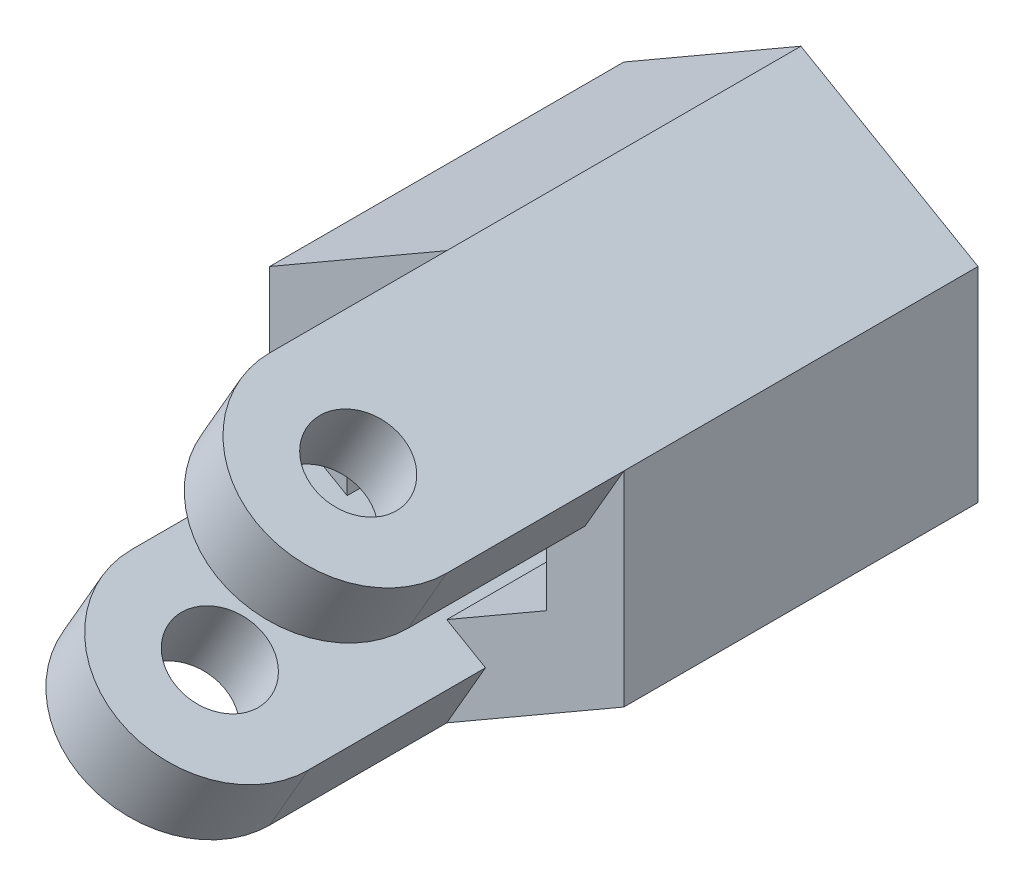
ISO-10303-21;
HEADER;
FILE_DESCRIPTION(('STEP AP214'),'2;1');
FILE_NAME('part.step','',(''),(''),'','','');
FILE_SCHEMA(('AUTOMOTIVE_DESIGN { 1 0 10303 214 1 1 1 1 }'));
ENDSEC;
DATA;
#1=APPLICATION_CONTEXT('core data for automotive mechanical design processes');
#2=APPLICATION_PROTOCOL_DEFINITION('international standard','automotive_design',2000,#1);
#3=PRODUCT_CONTEXT('',#1,'mechanical');
#4=PRODUCT('Part','Part','',(#3));
#5=PRODUCT_RELATED_PRODUCT_CATEGORY('part','',(#4));
#6=PRODUCT_DEFINITION_FORMATION('','',#4);
#7=PRODUCT_DEFINITION_CONTEXT('part definition',#1,'design');
#8=PRODUCT_DEFINITION('design','',#6,#7);
#9=PRODUCT_DEFINITION_SHAPE('','',#8);
#10=(LENGTH_UNIT() NAMED_UNIT(*) SI_UNIT(.MILLI.,.METRE.));
#11=(NAMED_UNIT(*) PLANE_ANGLE_UNIT() SI_UNIT($,.RADIAN.));
#12=(NAMED_UNIT(*) SI_UNIT($,.STERADIAN.) SOLID_ANGLE_UNIT());
#13=UNCERTAINTY_MEASURE_WITH_UNIT(LENGTH_MEASURE(1.E-05),#10,'distance_accuracy_value','');
#14=(GEOMETRIC_REPRESENTATION_CONTEXT(3) GLOBAL_UNCERTAINTY_ASSIGNED_CONTEXT((#13)) GLOBAL_UNIT_ASSIGNED_CONTEXT((#10,
#11,#12)) REPRESENTATION_CONTEXT('',''));
#15=CARTESIAN_POINT('',(0.,0.,0.));
#16=DIRECTION('',(0.,0.,1.));
#17=DIRECTION('',(1.,0.,0.));
#18=AXIS2_PLACEMENT_3D('',#15,#16,#17);
#19=CARTESIAN_POINT('',(0.,0.,6.));
#20=DIRECTION('',(0.,0.,1.));
#21=DIRECTION('',(1.,0.,0.));
#22=AXIS2_PLACEMENT_3D('',#19,#20,#21);
#23=PLANE('',#22);
#24=DIRECTION('',(-0.5,-0.866025403784439,0.));
#25=VECTOR('',#24,1.);
#26=CARTESIAN_POINT('',(4.78466351751448,3.6684781559393,6.));
#27=LINE('',#26,#25);
#28=CARTESIAN_POINT('',(0.875000000000009,-3.10325769689422,6.));
#29=VERTEX_POINT('',#28);
#30=CARTESIAN_POINT('',(0.,-4.61880215351701,6.));
#31=VERTEX_POINT('',#30);
#32=EDGE_CURVE('E174',#29,#31,#27,.T.);
#33=ORIENTED_EDGE('',*,*,#32,.T.);
#34=DIRECTION('',(0.866025403784439,0.5,0.));
#35=VECTOR('',#34,1.);
#36=CARTESIAN_POINT('',(0.,-4.618802153517,6.));
#37=LINE('',#36,#35);
#38=CARTESIAN_POINT('',(4.,-2.3094010767585,6.));
#39=VERTEX_POINT('',#38);
#40=EDGE_CURVE('E58',#31,#39,#37,.T.);
#41=ORIENTED_EDGE('',*,*,#40,.T.);
#42=DIRECTION('',(0.,1.,0.));
#43=VECTOR('',#42,1.);
#44=CARTESIAN_POINT('',(4.,-2.3094010767585,6.));
#45=LINE('',#44,#43);
#46=CARTESIAN_POINT('',(4.,2.3094010767585,6.));
#47=VERTEX_POINT('',#46);
#48=EDGE_CURVE('E300',#39,#47,#45,.T.);
#49=ORIENTED_EDGE('',*,*,#48,.T.);
#50=DIRECTION('',(0.5,0.866025403784438,0.));
#51=VECTOR('',#50,1.);
#52=CARTESIAN_POINT('',(-0.784663517514478,-5.97787923269779,6.));
#53=LINE('',#52,#51);
#54=CARTESIAN_POINT('',(3.12500000000001,0.79385662013575,6.));
#55=VERTEX_POINT('',#54);
#56=EDGE_CURVE('E221',#55,#47,#53,.T.);
#57=ORIENTED_EDGE('',*,*,#56,.F.);
#58=DIRECTION('',(-0.866025403784442,0.499999999999995,0.));
#59=VECTOR('',#58,1.);
#60=CARTESIAN_POINT('',(-0.875000000000047,3.10325769689425,6.));
#61=LINE('',#60,#59);
#62=CARTESIAN_POINT('',(2.24999999999998,1.29903810567668,6.));
#63=VERTEX_POINT('',#62);
#64=EDGE_CURVE('E43',#55,#63,#61,.T.);
#65=ORIENTED_EDGE('',*,*,#64,.T.);
#66=DIRECTION('',(0.,1.,0.));
#67=VECTOR('',#66,1.);
#68=CARTESIAN_POINT('',(2.25000000000001,-1.29903810567664,6.));
#69=LINE('',#68,#67);
#70=CARTESIAN_POINT('',(2.25000000000001,-1.29903810567664,6.));
#71=VERTEX_POINT('',#70);
#72=EDGE_CURVE('E267',#71,#63,#69,.T.);
#73=ORIENTED_EDGE('',*,*,#72,.F.);
#74=DIRECTION('',(0.866025403784435,0.500000000000007,0.));
#75=VECTOR('',#74,1.);
#76=CARTESIAN_POINT('',(0.,-2.59807621135331,6.));
#77=LINE('',#76,#75);
#78=CARTESIAN_POINT('',(0.,-2.59807621135331,6.));
#79=VERTEX_POINT('',#78);
#80=EDGE_CURVE('E265',#79,#71,#77,.T.);
#81=ORIENTED_EDGE('',*,*,#80,.F.);
#82=DIRECTION('',(0.866025403784442,-0.499999999999995,0.));
#83=VECTOR('',#82,1.);
#84=CARTESIAN_POINT('',(-3.12499999999997,-0.793856620135766,6.));
#85=LINE('',#84,#83);
#86=EDGE_CURVE('E175',#79,#29,#85,.T.);
#87=ORIENTED_EDGE('',*,*,#86,.T.);
#88=EDGE_LOOP('',(#33,#41,#49,#57,#65,#73,#81,#87));
#89=FACE_BOUND('',#88,.T.);
#90=ADVANCED_FACE('F33',(#89),#23,.T.);
#91=DIRECTION('',(-0.5,-0.866025403784439,0.));
#92=VECTOR('',#91,1.);
#93=CARTESIAN_POINT('',(0.784663517514478,5.9778792326978,6.));
#94=LINE('',#93,#92);
#95=CARTESIAN_POINT('',(-3.125,-0.793856620135743,6.));
#96=VERTEX_POINT('',#95);
#97=CARTESIAN_POINT('',(-4.,-2.30940107675851,6.));
#98=VERTEX_POINT('',#97);
#99=EDGE_CURVE('E181',#96,#98,#94,.T.);
#100=ORIENTED_EDGE('',*,*,#99,.F.);
#101=CARTESIAN_POINT('',(-2.24999999999999,-1.29903810567667,6.));
#102=VERTEX_POINT('',#101);
#103=EDGE_CURVE('E162',#96,#102,#85,.T.);
#104=ORIENTED_EDGE('',*,*,#103,.T.);
#105=DIRECTION('',(0.,-1.,0.));
#106=VECTOR('',#105,1.);
#107=CARTESIAN_POINT('',(-2.25,1.29903810567665,6.));
#108=LINE('',#107,#106);
#109=CARTESIAN_POINT('',(-2.25,1.29903810567665,6.));
#110=VERTEX_POINT('',#109);
#111=EDGE_CURVE('E262',#110,#102,#108,.T.);
#112=ORIENTED_EDGE('',*,*,#111,.F.);
#113=DIRECTION('',(-0.866025403784438,-0.500000000000001,0.));
#114=VECTOR('',#113,1.);
#115=CARTESIAN_POINT('',(0.,2.59807621135331,6.));
#116=LINE('',#115,#114);
#117=CARTESIAN_POINT('',(0.,2.59807621135331,6.));
#118=VERTEX_POINT('',#117);
#119=EDGE_CURVE('E260',#118,#110,#116,.T.);
#120=ORIENTED_EDGE('',*,*,#119,.F.);
#121=CARTESIAN_POINT('',(-0.875000000000005,3.10325769689423,6.));
#122=VERTEX_POINT('',#121);
#123=EDGE_CURVE('E11',#118,#122,#61,.T.);
#124=ORIENTED_EDGE('',*,*,#123,.T.);
#125=DIRECTION('',(0.5,0.866025403784438,0.));
#126=VECTOR('',#125,1.);
#127=CARTESIAN_POINT('',(-4.78466351751448,-3.66847815593928,6.));
#128=LINE('',#127,#126);
#129=CARTESIAN_POINT('',(0.,4.61880215351701,6.));
#130=VERTEX_POINT('',#129);
#131=EDGE_CURVE('E227',#122,#130,#128,.T.);
#132=ORIENTED_EDGE('',*,*,#131,.T.);
#133=DIRECTION('',(-0.866025403784439,-0.5,0.));
#134=VECTOR('',#133,1.);
#135=CARTESIAN_POINT('',(0.,4.61880215351701,6.));
#136=LINE('',#135,#134);
#137=CARTESIAN_POINT('',(-4.,2.3094010767585,6.));
#138=VERTEX_POINT('',#137);
#139=EDGE_CURVE('E296',#130,#138,#136,.T.);
#140=ORIENTED_EDGE('',*,*,#139,.T.);
#141=DIRECTION('',(0.,-1.,0.));
#142=VECTOR('',#141,1.);
#143=CARTESIAN_POINT('',(-4.,2.3094010767585,6.));
#144=LINE('',#143,#142);
#145=EDGE_CURVE('E188',#138,#98,#144,.T.);
#146=ORIENTED_EDGE('',*,*,#145,.T.);
#147=EDGE_LOOP('',(#100,#104,#112,#120,#124,#132,#140,#146));
#148=FACE_BOUND('',#147,.T.);
#149=ADVANCED_FACE('F186',(#148),#23,.T.);
#150=CARTESIAN_POINT('',(4.,2.3094010767585,6.));
#151=DIRECTION('',(-0.5,-0.866025403784438,0.));
#152=DIRECTION('',(0.866025403784439,-0.5,0.));
#153=AXIS2_PLACEMENT_3D('',#150,#151,#152);
#154=PLANE('',#153);
#155=DIRECTION('',(0.,0.,-1.));
#156=VECTOR('',#155,1.);
#157=CARTESIAN_POINT('',(4.,2.3094010767585,6.));
#158=LINE('',#157,#156);
#159=CARTESIAN_POINT('',(4.,2.3094010767585,-2.));
#160=VERTEX_POINT('',#159);
#161=EDGE_CURVE('E302',#47,#160,#158,.T.);
#162=ORIENTED_EDGE('',*,*,#161,.T.);
#163=DIRECTION('',(0.866025403784439,-0.5,0.));
#164=VECTOR('',#163,1.);
#165=CARTESIAN_POINT('',(0.,4.61880215351701,-2.));
#166=LINE('',#165,#164);
#167=CARTESIAN_POINT('',(0.,4.61880215351701,-2.));
#168=VERTEX_POINT('',#167);
#169=EDGE_CURVE('E244',#168,#160,#166,.T.);
#170=ORIENTED_EDGE('',*,*,#169,.F.);
#171=DIRECTION('',(0.,0.,-1.));
#172=VECTOR('',#171,1.);
#173=CARTESIAN_POINT('',(0.,4.61880215351701,6.));
#174=LINE('',#173,#172);
#175=EDGE_CURVE('E37',#130,#168,#174,.T.);
#176=ORIENTED_EDGE('',*,*,#175,.F.);
#177=DIRECTION('',(0.,0.,1.));
#178=VECTOR('',#177,1.);
#179=CARTESIAN_POINT('',(0.,4.61880215351701,6.));
#180=LINE('',#179,#178);
#181=CARTESIAN_POINT('',(0.,4.61880215351701,10.));
#182=VERTEX_POINT('',#181);
#183=EDGE_CURVE('E208',#130,#182,#180,.T.);
#184=ORIENTED_EDGE('',*,*,#183,.T.);
#185=CARTESIAN_POINT('',(2.,3.46410161513776,10.));
#186=DIRECTION('',(0.5,0.866025403784438,0.));
#187=DIRECTION('',(-0.866025403784439,0.5,0.));
#188=AXIS2_PLACEMENT_3D('',#185,#186,#187);
#189=CIRCLE('',#188,2.3094010767585);
#190=CARTESIAN_POINT('',(4.,2.3094010767585,10.));
#191=VERTEX_POINT('',#190);
#192=EDGE_CURVE('E205',#182,#191,#189,.T.);
#193=ORIENTED_EDGE('',*,*,#192,.T.);
#194=DIRECTION('',(0.,0.,-1.));
#195=VECTOR('',#194,1.);
#196=CARTESIAN_POINT('',(4.,2.3094010767585,6.));
#197=LINE('',#196,#195);
#198=EDGE_CURVE('E201',#191,#47,#197,.T.);
#199=ORIENTED_EDGE('',*,*,#198,.T.);
#200=EDGE_LOOP('',(#162,#170,#176,#184,#193,#199));
#201=FACE_BOUND('',#200,.T.);
#202=CARTESIAN_POINT('',(2.,3.46410161513776,10.));
#203=DIRECTION('',(0.5,0.866025403784438,0.));
#204=DIRECTION('',(-0.866025403784439,0.5,0.));
#205=AXIS2_PLACEMENT_3D('',#202,#203,#204);
#206=CIRCLE('',#205,1.);
#207=CARTESIAN_POINT('',(1.13397459621556,3.96410161513776,10.));
#208=VERTEX_POINT('',#207);
#209=EDGE_CURVE('E211',#208,#208,#206,.T.);
#210=ORIENTED_EDGE('',*,*,#209,.F.);
#211=EDGE_LOOP('',(#210));
#212=FACE_BOUND('',#211,.T.);
#213=ADVANCED_FACE('F35',(#201,#212),#154,.F.);
#214=CARTESIAN_POINT('',(0.,4.61880215351701,6.));
#215=DIRECTION('',(0.5,-0.866025403784439,0.));
#216=DIRECTION('',(0.866025403784439,0.5,0.));
#217=AXIS2_PLACEMENT_3D('',#214,#215,#216);
#218=PLANE('',#217);
#219=ORIENTED_EDGE('',*,*,#175,.T.);
#220=DIRECTION('',(0.866025403784439,0.5,0.));
#221=VECTOR('',#220,1.);
#222=CARTESIAN_POINT('',(-4.,2.3094010767585,-2.));
#223=LINE('',#222,#221);
#224=CARTESIAN_POINT('',(-4.,2.3094010767585,-2.));
#225=VERTEX_POINT('',#224);
#226=EDGE_CURVE('E239',#225,#168,#223,.T.);
#227=ORIENTED_EDGE('',*,*,#226,.F.);
#228=DIRECTION('',(0.,0.,-1.));
#229=VECTOR('',#228,1.);
#230=CARTESIAN_POINT('',(-4.,2.3094010767585,6.));
#231=LINE('',#230,#229);
#232=EDGE_CURVE('E309',#138,#225,#231,.T.);
#233=ORIENTED_EDGE('',*,*,#232,.F.);
#234=ORIENTED_EDGE('',*,*,#139,.F.);
#235=EDGE_LOOP('',(#219,#227,#233,#234));
#236=FACE_BOUND('',#235,.T.);
#237=ADVANCED_FACE('F318',(#236),#218,.F.);
#238=CARTESIAN_POINT('',(-4.,2.3094010767585,6.));
#239=DIRECTION('',(1.,0.,0.));
#240=DIRECTION('',(0.,1.,0.));
#241=AXIS2_PLACEMENT_3D('',#238,#239,#240);
#242=PLANE('',#241);
#243=ORIENTED_EDGE('',*,*,#232,.T.);
#244=DIRECTION('',(0.,1.,0.));
#245=VECTOR('',#244,1.);
#246=CARTESIAN_POINT('',(-4.,-2.30940107675851,-2.));
#247=LINE('',#246,#245);
#248=CARTESIAN_POINT('',(-4.,-2.30940107675851,-2.));
#249=VERTEX_POINT('',#248);
#250=EDGE_CURVE('E256',#249,#225,#247,.T.);
#251=ORIENTED_EDGE('',*,*,#250,.F.);
#252=DIRECTION('',(0.,0.,-1.));
#253=VECTOR('',#252,1.);
#254=CARTESIAN_POINT('',(-4.,-2.3094010767585,6.));
#255=LINE('',#254,#253);
#256=EDGE_CURVE('E308',#98,#249,#255,.T.);
#257=ORIENTED_EDGE('',*,*,#256,.F.);
#258=ORIENTED_EDGE('',*,*,#145,.F.);
#259=EDGE_LOOP('',(#243,#251,#257,#258));
#260=FACE_BOUND('',#259,.T.);
#261=ADVANCED_FACE('F327',(#260),#242,.F.);
#262=CARTESIAN_POINT('',(-4.,-2.3094010767585,6.));
#263=DIRECTION('',(0.5,0.866025403784439,0.));
#264=DIRECTION('',(-0.866025403784439,0.5,0.));
#265=AXIS2_PLACEMENT_3D('',#262,#263,#264);
#266=PLANE('',#265);
#267=ORIENTED_EDGE('',*,*,#256,.T.);
#268=DIRECTION('',(-0.866025403784439,0.5,0.));
#269=VECTOR('',#268,1.);
#270=CARTESIAN_POINT('',(0.,-4.61880215351701,-2.));
#271=LINE('',#270,#269);
#272=CARTESIAN_POINT('',(0.,-4.61880215351701,-2.));
#273=VERTEX_POINT('',#272);
#274=EDGE_CURVE('E253',#273,#249,#271,.T.);
#275=ORIENTED_EDGE('',*,*,#274,.F.);
#276=DIRECTION('',(0.,0.,-1.));
#277=VECTOR('',#276,1.);
#278=CARTESIAN_POINT('',(0.,-4.618802153517,6.));
#279=LINE('',#278,#277);
#280=EDGE_CURVE('E306',#31,#273,#279,.T.);
#281=ORIENTED_EDGE('',*,*,#280,.F.);
#282=DIRECTION('',(0.,0.,1.));
#283=VECTOR('',#282,1.);
#284=CARTESIAN_POINT('',(0.,-4.61880215351701,10.));
#285=LINE('',#284,#283);
#286=CARTESIAN_POINT('',(0.,-4.61880215351701,10.));
#287=VERTEX_POINT('',#286);
#288=EDGE_CURVE('E336',#31,#287,#285,.T.);
#289=ORIENTED_EDGE('',*,*,#288,.T.);
#290=CARTESIAN_POINT('',(-2.,-3.46410161513776,10.));
#291=DIRECTION('',(-0.5,-0.866025403784439,0.));
#292=DIRECTION('',(0.866025403784439,-0.5,0.));
#293=AXIS2_PLACEMENT_3D('',#290,#291,#292);
#294=CIRCLE('',#293,2.3094010767585);
#295=CARTESIAN_POINT('',(-4.,-2.30940107675851,10.));
#296=VERTEX_POINT('',#295);
#297=EDGE_CURVE('E193',#287,#296,#294,.T.);
#298=ORIENTED_EDGE('',*,*,#297,.T.);
#299=DIRECTION('',(0.,0.,-1.));
#300=VECTOR('',#299,1.);
#301=CARTESIAN_POINT('',(-4.,-2.30940107675851,10.));
#302=LINE('',#301,#300);
#303=EDGE_CURVE('E333',#296,#98,#302,.T.);
#304=ORIENTED_EDGE('',*,*,#303,.T.);
#305=EDGE_LOOP('',(#267,#275,#281,#289,#298,#304));
#306=FACE_BOUND('',#305,.T.);
#307=CARTESIAN_POINT('',(-2.,-3.46410161513776,10.));
#308=DIRECTION('',(-0.5,-0.866025403784439,0.));
#309=DIRECTION('',(0.866025403784439,-0.5,0.));
#310=AXIS2_PLACEMENT_3D('',#307,#308,#309);
#311=CIRCLE('',#310,1.);
#312=CARTESIAN_POINT('',(-1.13397459621556,-3.96410161513776,10.));
#313=VERTEX_POINT('',#312);
#314=EDGE_CURVE('E190',#313,#313,#311,.T.);
#315=ORIENTED_EDGE('',*,*,#314,.F.);
#316=EDGE_LOOP('',(#315));
#317=FACE_BOUND('',#316,.T.);
#318=ADVANCED_FACE('F329',(#306,#317),#266,.F.);
#319=CARTESIAN_POINT('',(0.,-4.618802153517,6.));
#320=DIRECTION('',(-0.5,0.866025403784439,0.));
#321=DIRECTION('',(-0.866025403784439,-0.5,0.));
#322=AXIS2_PLACEMENT_3D('',#319,#320,#321);
#323=PLANE('',#322);
#324=ORIENTED_EDGE('',*,*,#280,.T.);
#325=DIRECTION('',(-0.866025403784439,-0.5,0.));
#326=VECTOR('',#325,1.);
#327=CARTESIAN_POINT('',(4.,-2.30940107675851,-2.));
#328=LINE('',#327,#326);
#329=CARTESIAN_POINT('',(4.,-2.30940107675851,-2.));
#330=VERTEX_POINT('',#329);
#331=EDGE_CURVE('E250',#330,#273,#328,.T.);
#332=ORIENTED_EDGE('',*,*,#331,.F.);
#333=DIRECTION('',(0.,0.,-1.));
#334=VECTOR('',#333,1.);
#335=CARTESIAN_POINT('',(4.,-2.3094010767585,6.));
#336=LINE('',#335,#334);
#337=EDGE_CURVE('E304',#39,#330,#336,.T.);
#338=ORIENTED_EDGE('',*,*,#337,.F.);
#339=ORIENTED_EDGE('',*,*,#40,.F.);
#340=EDGE_LOOP('',(#324,#332,#338,#339));
#341=FACE_BOUND('',#340,.T.);
#342=ADVANCED_FACE('F383',(#341),#323,.F.);
#343=CARTESIAN_POINT('',(4.,-2.3094010767585,6.));
#344=DIRECTION('',(-1.,0.,0.));
#345=DIRECTION('',(0.,0.,1.));
#346=AXIS2_PLACEMENT_3D('',#343,#344,#345);
#347=PLANE('',#346);
#348=ORIENTED_EDGE('',*,*,#337,.T.);
#349=DIRECTION('',(0.,-1.,0.));
#350=VECTOR('',#349,1.);
#351=CARTESIAN_POINT('',(4.,2.3094010767585,-2.));
#352=LINE('',#351,#350);
#353=EDGE_CURVE('E247',#160,#330,#352,.T.);
#354=ORIENTED_EDGE('',*,*,#353,.F.);
#355=ORIENTED_EDGE('',*,*,#161,.F.);
#356=ORIENTED_EDGE('',*,*,#48,.F.);
#357=EDGE_LOOP('',(#348,#354,#355,#356));
#358=FACE_BOUND('',#357,.T.);
#359=ADVANCED_FACE('F380',(#358),#347,.F.);
#360=CARTESIAN_POINT('',(2.24999999999998,1.29903810567668,6.));
#361=DIRECTION('',(-0.499999999999995,-0.866025403784441,0.));
#362=DIRECTION('',(0.866025403784442,-0.499999999999995,0.));
#363=AXIS2_PLACEMENT_3D('',#360,#361,#362);
#364=PLANE('',#363);
#365=DIRECTION('',(-0.866025403784442,0.499999999999995,0.));
#366=VECTOR('',#365,1.);
#367=CARTESIAN_POINT('',(2.24999999999998,1.29903810567668,0.));
#368=LINE('',#367,#366);
#369=CARTESIAN_POINT('',(2.24999999999998,1.29903810567668,0.));
#370=VERTEX_POINT('',#369);
#371=CARTESIAN_POINT('',(0.,2.59807621135331,0.));
#372=VERTEX_POINT('',#371);
#373=EDGE_CURVE('E259',#370,#372,#368,.T.);
#374=ORIENTED_EDGE('',*,*,#373,.F.);
#375=DIRECTION('',(0.,0.,-1.));
#376=VECTOR('',#375,1.);
#377=CARTESIAN_POINT('',(2.24999999999998,1.29903810567668,6.));
#378=LINE('',#377,#376);
#379=EDGE_CURVE('E269',#63,#370,#378,.T.);
#380=ORIENTED_EDGE('',*,*,#379,.F.);
#381=ORIENTED_EDGE('',*,*,#64,.F.);
#382=DIRECTION('',(0.,0.,-1.));
#383=VECTOR('',#382,1.);
#384=CARTESIAN_POINT('',(3.12500000000001,0.79385662013575,6.));
#385=LINE('',#384,#383);
#386=CARTESIAN_POINT('',(3.12500000000001,0.793856620135749,10.));
#387=VERTEX_POINT('',#386);
#388=EDGE_CURVE('E228',#387,#55,#385,.T.);
#389=ORIENTED_EDGE('',*,*,#388,.F.);
#390=CARTESIAN_POINT('',(1.125,1.94855715851499,10.));
#391=DIRECTION('',(-0.499999999999995,-0.866025403784441,0.));
#392=DIRECTION('',(0.866025403784442,-0.499999999999995,0.));
#393=AXIS2_PLACEMENT_3D('',#390,#391,#392);
#394=CIRCLE('',#393,2.3094010767585);
#395=CARTESIAN_POINT('',(-0.875000000000005,3.10325769689423,10.));
#396=VERTEX_POINT('',#395);
#397=EDGE_CURVE('E218',#396,#387,#394,.F.);
#398=ORIENTED_EDGE('',*,*,#397,.F.);
#399=DIRECTION('',(0.,0.,1.));
#400=VECTOR('',#399,1.);
#401=CARTESIAN_POINT('',(-0.875000000000004,3.10325769689423,6.));
#402=LINE('',#401,#400);
#403=EDGE_CURVE('E222',#122,#396,#402,.T.);
#404=ORIENTED_EDGE('',*,*,#403,.F.);
#405=ORIENTED_EDGE('',*,*,#123,.F.);
#406=DIRECTION('',(0.,0.,-1.));
#407=VECTOR('',#406,1.);
#408=CARTESIAN_POINT('',(0.,2.59807621135331,6.));
#409=LINE('',#408,#407);
#410=EDGE_CURVE('E293',#118,#372,#409,.T.);
#411=ORIENTED_EDGE('',*,*,#410,.T.);
#412=EDGE_LOOP('',(#374,#380,#381,#389,#398,#404,#405,#411));
#413=FACE_BOUND('',#412,.T.);
#414=CARTESIAN_POINT('',(1.125,1.94855715851499,10.));
#415=DIRECTION('',(-0.499999999999995,-0.866025403784441,0.));
#416=DIRECTION('',(0.866025403784442,-0.499999999999995,0.));
#417=AXIS2_PLACEMENT_3D('',#414,#415,#416);
#418=CIRCLE('',#417,1.);
#419=CARTESIAN_POINT('',(1.99102540378444,1.44855715851499,10.));
#420=VERTEX_POINT('',#419);
#421=EDGE_CURVE('E204',#420,#420,#418,.F.);
#422=ORIENTED_EDGE('',*,*,#421,.T.);
#423=EDGE_LOOP('',(#422));
#424=FACE_BOUND('',#423,.T.);
#425=ADVANCED_FACE('F369',(#413,#424),#364,.T.);
#426=CARTESIAN_POINT('',(0.,2.59807621135331,6.));
#427=DIRECTION('',(0.500000000000001,-0.866025403784438,0.));
#428=DIRECTION('',(0.866025403784438,0.500000000000001,0.));
#429=AXIS2_PLACEMENT_3D('',#426,#427,#428);
#430=PLANE('',#429);
#431=DIRECTION('',(-0.866025403784438,-0.500000000000001,0.));
#432=VECTOR('',#431,1.);
#433=CARTESIAN_POINT('',(0.,2.59807621135331,0.));
#434=LINE('',#433,#432);
#435=CARTESIAN_POINT('',(-2.25,1.29903810567665,0.));
#436=VERTEX_POINT('',#435);
#437=EDGE_CURVE('E272',#372,#436,#434,.T.);
#438=ORIENTED_EDGE('',*,*,#437,.F.);
#439=ORIENTED_EDGE('',*,*,#410,.F.);
#440=ORIENTED_EDGE('',*,*,#119,.T.);
#441=DIRECTION('',(0.,0.,-1.));
#442=VECTOR('',#441,1.);
#443=CARTESIAN_POINT('',(-2.25,1.29903810567665,6.));
#444=LINE('',#443,#442);
#445=EDGE_CURVE('E291',#110,#436,#444,.T.);
#446=ORIENTED_EDGE('',*,*,#445,.T.);
#447=EDGE_LOOP('',(#438,#439,#440,#446));
#448=FACE_BOUND('',#447,.T.);
#449=ADVANCED_FACE('F366',(#448),#430,.T.);
#450=CARTESIAN_POINT('',(-2.25,1.29903810567665,6.));
#451=DIRECTION('',(1.,0.,0.));
#452=DIRECTION('',(0.,1.,0.));
#453=AXIS2_PLACEMENT_3D('',#450,#451,#452);
#454=PLANE('',#453);
#455=DIRECTION('',(0.,-1.,0.));
#456=VECTOR('',#455,1.);
#457=CARTESIAN_POINT('',(-2.25,1.29903810567665,0.));
#458=LINE('',#457,#456);
#459=CARTESIAN_POINT('',(-2.24999999999999,-1.29903810567667,0.));
#460=VERTEX_POINT('',#459);
#461=EDGE_CURVE('E275',#436,#460,#458,.T.);
#462=ORIENTED_EDGE('',*,*,#461,.F.);
#463=ORIENTED_EDGE('',*,*,#445,.F.);
#464=ORIENTED_EDGE('',*,*,#111,.T.);
#465=DIRECTION('',(0.,0.,-1.));
#466=VECTOR('',#465,1.);
#467=CARTESIAN_POINT('',(-2.24999999999999,-1.29903810567667,6.));
#468=LINE('',#467,#466);
#469=EDGE_CURVE('E169',#102,#460,#468,.T.);
#470=ORIENTED_EDGE('',*,*,#469,.T.);
#471=EDGE_LOOP('',(#462,#463,#464,#470));
#472=FACE_BOUND('',#471,.T.);
#473=ADVANCED_FACE('F362',(#472),#454,.T.);
#474=CARTESIAN_POINT('',(-2.24999999999999,-1.29903810567667,6.));
#475=DIRECTION('',(0.499999999999995,0.866025403784441,0.));
#476=DIRECTION('',(-0.866025403784442,0.499999999999995,0.));
#477=AXIS2_PLACEMENT_3D('',#474,#475,#476);
#478=PLANE('',#477);
#479=DIRECTION('',(0.866025403784442,-0.499999999999995,0.));
#480=VECTOR('',#479,1.);
#481=CARTESIAN_POINT('',(-2.24999999999999,-1.29903810567667,0.));
#482=LINE('',#481,#480);
#483=CARTESIAN_POINT('',(0.,-2.59807621135331,0.));
#484=VERTEX_POINT('',#483);
#485=EDGE_CURVE('E278',#460,#484,#482,.T.);
#486=ORIENTED_EDGE('',*,*,#485,.F.);
#487=ORIENTED_EDGE('',*,*,#469,.F.);
#488=ORIENTED_EDGE('',*,*,#103,.F.);
#489=DIRECTION('',(0.,0.,-1.));
#490=VECTOR('',#489,1.);
#491=CARTESIAN_POINT('',(-3.125,-0.793856620135744,10.));
#492=LINE('',#491,#490);
#493=CARTESIAN_POINT('',(-3.125,-0.793856620135744,10.));
#494=VERTEX_POINT('',#493);
#495=EDGE_CURVE('E167',#494,#96,#492,.T.);
#496=ORIENTED_EDGE('',*,*,#495,.F.);
#497=CARTESIAN_POINT('',(-1.125,-1.94855715851498,10.));
#498=DIRECTION('',(0.499999999999995,0.866025403784441,0.));
#499=DIRECTION('',(-0.866025403784442,0.499999999999995,0.));
#500=AXIS2_PLACEMENT_3D('',#497,#498,#499);
#501=CIRCLE('',#500,2.3094010767585);
#502=CARTESIAN_POINT('',(0.875000000000009,-3.10325769689422,10.));
#503=VERTEX_POINT('',#502);
#504=EDGE_CURVE('E200',#503,#494,#501,.F.);
#505=ORIENTED_EDGE('',*,*,#504,.F.);
#506=DIRECTION('',(0.,0.,1.));
#507=VECTOR('',#506,1.);
#508=CARTESIAN_POINT('',(0.875000000000009,-3.10325769689422,10.));
#509=LINE('',#508,#507);
#510=EDGE_CURVE('E199',#29,#503,#509,.T.);
#511=ORIENTED_EDGE('',*,*,#510,.F.);
#512=ORIENTED_EDGE('',*,*,#86,.F.);
#513=DIRECTION('',(0.,0.,-1.));
#514=VECTOR('',#513,1.);
#515=CARTESIAN_POINT('',(0.,-2.59807621135331,6.));
#516=LINE('',#515,#514);
#517=EDGE_CURVE('E288',#79,#484,#516,.T.);
#518=ORIENTED_EDGE('',*,*,#517,.T.);
#519=EDGE_LOOP('',(#486,#487,#488,#496,#505,#511,#512,#518));
#520=FACE_BOUND('',#519,.T.);
#521=CARTESIAN_POINT('',(-1.125,-1.94855715851498,10.));
#522=DIRECTION('',(0.499999999999995,0.866025403784441,0.));
#523=DIRECTION('',(-0.866025403784442,0.499999999999995,0.));
#524=AXIS2_PLACEMENT_3D('',#521,#522,#523);
#525=CIRCLE('',#524,1.);
#526=CARTESIAN_POINT('',(-1.99102540378444,-1.44855715851499,10.));
#527=VERTEX_POINT('',#526);
#528=EDGE_CURVE('E225',#527,#527,#525,.F.);
#529=ORIENTED_EDGE('',*,*,#528,.T.);
#530=EDGE_LOOP('',(#529));
#531=FACE_BOUND('',#530,.T.);
#532=ADVANCED_FACE('F165',(#520,#531),#478,.T.);
#533=CARTESIAN_POINT('',(0.,-2.59807621135331,6.));
#534=DIRECTION('',(-0.500000000000007,0.866025403784434,0.));
#535=DIRECTION('',(-0.866025403784435,-0.500000000000007,0.));
#536=AXIS2_PLACEMENT_3D('',#533,#534,#535);
#537=PLANE('',#536);
#538=DIRECTION('',(0.866025403784435,0.500000000000007,0.));
#539=VECTOR('',#538,1.);
#540=CARTESIAN_POINT('',(0.,-2.59807621135331,0.));
#541=LINE('',#540,#539);
#542=CARTESIAN_POINT('',(2.25000000000001,-1.29903810567664,0.));
#543=VERTEX_POINT('',#542);
#544=EDGE_CURVE('E281',#484,#543,#541,.T.);
#545=ORIENTED_EDGE('',*,*,#544,.F.);
#546=ORIENTED_EDGE('',*,*,#517,.F.);
#547=ORIENTED_EDGE('',*,*,#80,.T.);
#548=DIRECTION('',(0.,0.,-1.));
#549=VECTOR('',#548,1.);
#550=CARTESIAN_POINT('',(2.25000000000001,-1.29903810567664,6.));
#551=LINE('',#550,#549);
#552=EDGE_CURVE('E50',#71,#543,#551,.T.);
#553=ORIENTED_EDGE('',*,*,#552,.T.);
#554=EDGE_LOOP('',(#545,#546,#547,#553));
#555=FACE_BOUND('',#554,.T.);
#556=ADVANCED_FACE('F355',(#555),#537,.T.);
#557=CARTESIAN_POINT('',(2.25000000000001,-1.29903810567664,6.));
#558=DIRECTION('',(-1.,0.,0.));
#559=DIRECTION('',(0.,-1.,0.));
#560=AXIS2_PLACEMENT_3D('',#557,#558,#559);
#561=PLANE('',#560);
#562=DIRECTION('',(0.,1.,0.));
#563=VECTOR('',#562,1.);
#564=CARTESIAN_POINT('',(2.25000000000001,-1.29903810567664,0.));
#565=LINE('',#564,#563);
#566=EDGE_CURVE('E263',#543,#370,#565,.T.);
#567=ORIENTED_EDGE('',*,*,#566,.F.);
#568=ORIENTED_EDGE('',*,*,#552,.F.);
#569=ORIENTED_EDGE('',*,*,#72,.T.);
#570=ORIENTED_EDGE('',*,*,#379,.T.);
#571=EDGE_LOOP('',(#567,#568,#569,#570));
#572=FACE_BOUND('',#571,.T.);
#573=ADVANCED_FACE('F372',(#572),#561,.T.);
#574=CARTESIAN_POINT('',(0.,0.,-2.));
#575=DIRECTION('',(0.,0.,-1.));
#576=DIRECTION('',(-1.,0.,0.));
#577=AXIS2_PLACEMENT_3D('',#574,#575,#576);
#578=PLANE('',#577);
#579=ORIENTED_EDGE('',*,*,#226,.T.);
#580=ORIENTED_EDGE('',*,*,#169,.T.);
#581=ORIENTED_EDGE('',*,*,#353,.T.);
#582=ORIENTED_EDGE('',*,*,#331,.T.);
#583=ORIENTED_EDGE('',*,*,#274,.T.);
#584=ORIENTED_EDGE('',*,*,#250,.T.);
#585=EDGE_LOOP('',(#579,#580,#581,#582,#583,#584));
#586=FACE_BOUND('',#585,.T.);
#587=CARTESIAN_POINT('',(0.,0.,-2.));
#588=DIRECTION('',(0.,0.,-1.));
#589=DIRECTION('',(-1.,0.,0.));
#590=AXIS2_PLACEMENT_3D('',#587,#588,#589);
#591=CIRCLE('',#590,1.25);
#592=CARTESIAN_POINT('',(-1.25,0.,-2.));
#593=VERTEX_POINT('',#592);
#594=EDGE_CURVE('E236',#593,#593,#591,.T.);
#595=ORIENTED_EDGE('',*,*,#594,.F.);
#596=EDGE_LOOP('',(#595));
#597=FACE_BOUND('',#596,.T.);
#598=ADVANCED_FACE('F324',(#586,#597),#578,.T.);
#599=CARTESIAN_POINT('',(0.,0.,0.));
#600=DIRECTION('',(0.,0.,-1.));
#601=DIRECTION('',(-1.,0.,0.));
#602=AXIS2_PLACEMENT_3D('',#599,#600,#601);
#603=PLANE('',#602);
#604=ORIENTED_EDGE('',*,*,#373,.T.);
#605=ORIENTED_EDGE('',*,*,#437,.T.);
#606=ORIENTED_EDGE('',*,*,#461,.T.);
#607=ORIENTED_EDGE('',*,*,#485,.T.);
#608=ORIENTED_EDGE('',*,*,#544,.T.);
#609=ORIENTED_EDGE('',*,*,#566,.T.);
#610=EDGE_LOOP('',(#604,#605,#606,#607,#608,#609));
#611=FACE_BOUND('',#610,.T.);
#612=CARTESIAN_POINT('',(0.,0.,0.));
#613=DIRECTION('',(0.,0.,-1.));
#614=DIRECTION('',(-1.,0.,0.));
#615=AXIS2_PLACEMENT_3D('',#612,#613,#614);
#616=CIRCLE('',#615,1.25);
#617=CARTESIAN_POINT('',(-1.25,0.,0.));
#618=VERTEX_POINT('',#617);
#619=EDGE_CURVE('E217',#618,#618,#616,.T.);
#620=ORIENTED_EDGE('',*,*,#619,.T.);
#621=EDGE_LOOP('',(#620));
#622=FACE_BOUND('',#621,.T.);
#623=ADVANCED_FACE('F357',(#611,#622),#603,.F.);
#624=CARTESIAN_POINT('',(0.,0.,-2.));
#625=DIRECTION('',(0.,0.,1.));
#626=DIRECTION('',(1.,0.,0.));
#627=AXIS2_PLACEMENT_3D('',#624,#625,#626);
#628=CYLINDRICAL_SURFACE('',#627,1.25);
#629=ORIENTED_EDGE('',*,*,#594,.T.);
#630=EDGE_LOOP('',(#629));
#631=FACE_BOUND('',#630,.T.);
#632=ORIENTED_EDGE('',*,*,#619,.F.);
#633=EDGE_LOOP('',(#632));
#634=FACE_BOUND('',#633,.T.);
#635=ADVANCED_FACE('F520',(#631,#634),#628,.F.);
#636=CARTESIAN_POINT('',(-4.78466351751448,-3.66847815593928,6.));
#637=DIRECTION('',(-0.866025403784438,0.5,0.));
#638=DIRECTION('',(-0.5,-0.866025403784439,0.));
#639=AXIS2_PLACEMENT_3D('',#636,#637,#638);
#640=PLANE('',#639);
#641=ORIENTED_EDGE('',*,*,#131,.F.);
#642=ORIENTED_EDGE('',*,*,#403,.T.);
#643=DIRECTION('',(0.5,0.866025403784438,0.));
#644=VECTOR('',#643,1.);
#645=CARTESIAN_POINT('',(-4.78466351751448,-3.66847815593928,10.));
#646=LINE('',#645,#644);
#647=EDGE_CURVE('E224',#396,#182,#646,.T.);
#648=ORIENTED_EDGE('',*,*,#647,.T.);
#649=ORIENTED_EDGE('',*,*,#183,.F.);
#650=EDGE_LOOP('',(#641,#642,#648,#649));
#651=FACE_BOUND('',#650,.T.);
#652=ADVANCED_FACE('F517',(#651),#640,.T.);
#653=CARTESIAN_POINT('',(-0.784663517514478,-5.97787923269779,6.));
#654=DIRECTION('',(0.866025403784438,-0.5,0.));
#655=DIRECTION('',(0.5,0.866025403784439,0.));
#656=AXIS2_PLACEMENT_3D('',#653,#654,#655);
#657=PLANE('',#656);
#658=DIRECTION('',(0.5,0.866025403784438,0.));
#659=VECTOR('',#658,1.);
#660=CARTESIAN_POINT('',(-0.784663517514477,-5.97787923269779,10.));
#661=LINE('',#660,#659);
#662=EDGE_CURVE('E214',#387,#191,#661,.T.);
#663=ORIENTED_EDGE('',*,*,#662,.F.);
#664=ORIENTED_EDGE('',*,*,#388,.T.);
#665=ORIENTED_EDGE('',*,*,#56,.T.);
#666=ORIENTED_EDGE('',*,*,#198,.F.);
#667=EDGE_LOOP('',(#663,#664,#665,#666));
#668=FACE_BOUND('',#667,.T.);
#669=ADVANCED_FACE('F376',(#668),#657,.T.);
#670=CARTESIAN_POINT('',(-2.78466351751448,-4.82317869431854,10.));
#671=DIRECTION('',(0.5,0.866025403784438,0.));
#672=DIRECTION('',(-0.866025403784439,0.5,0.));
#673=AXIS2_PLACEMENT_3D('',#670,#671,#672);
#674=CYLINDRICAL_SURFACE('',#673,2.3094010767585);
#675=ORIENTED_EDGE('',*,*,#647,.F.);
#676=ORIENTED_EDGE('',*,*,#397,.T.);
#677=ORIENTED_EDGE('',*,*,#662,.T.);
#678=ORIENTED_EDGE('',*,*,#192,.F.);
#679=EDGE_LOOP('',(#675,#676,#677,#678));
#680=FACE_BOUND('',#679,.T.);
#681=ADVANCED_FACE('F511',(#680),#674,.T.);
#682=CARTESIAN_POINT('',(-2.78466351751448,-4.82317869431854,10.));
#683=DIRECTION('',(0.5,0.866025403784438,0.));
#684=DIRECTION('',(-0.866025403784439,0.5,0.));
#685=AXIS2_PLACEMENT_3D('',#682,#683,#684);
#686=CYLINDRICAL_SURFACE('',#685,1.);
#687=ORIENTED_EDGE('',*,*,#209,.T.);
#688=EDGE_LOOP('',(#687));
#689=FACE_BOUND('',#688,.T.);
#690=ORIENTED_EDGE('',*,*,#421,.F.);
#691=EDGE_LOOP('',(#690));
#692=FACE_BOUND('',#691,.T.);
#693=ADVANCED_FACE('F394',(#689,#692),#686,.F.);
#694=CARTESIAN_POINT('',(2.78466351751448,4.82317869431854,10.));
#695=DIRECTION('',(-0.5,-0.866025403784439,0.));
#696=DIRECTION('',(0.866025403784439,-0.5,0.));
#697=AXIS2_PLACEMENT_3D('',#694,#695,#696);
#698=CYLINDRICAL_SURFACE('',#697,2.3094010767585);
#699=DIRECTION('',(-0.5,-0.866025403784439,0.));
#700=VECTOR('',#699,1.);
#701=CARTESIAN_POINT('',(4.78466351751448,3.6684781559393,10.));
#702=LINE('',#701,#700);
#703=EDGE_CURVE('E345',#503,#287,#702,.T.);
#704=ORIENTED_EDGE('',*,*,#703,.F.);
#705=ORIENTED_EDGE('',*,*,#504,.T.);
#706=DIRECTION('',(-0.5,-0.866025403784439,0.));
#707=VECTOR('',#706,1.);
#708=CARTESIAN_POINT('',(0.784663517514478,5.9778792326978,10.));
#709=LINE('',#708,#707);
#710=EDGE_CURVE('E183',#494,#296,#709,.T.);
#711=ORIENTED_EDGE('',*,*,#710,.T.);
#712=ORIENTED_EDGE('',*,*,#297,.F.);
#713=EDGE_LOOP('',(#704,#705,#711,#712));
#714=FACE_BOUND('',#713,.T.);
#715=ADVANCED_FACE('F386',(#714),#698,.T.);
#716=CARTESIAN_POINT('',(4.78466351751448,3.6684781559393,10.));
#717=DIRECTION('',(0.866025403784439,-0.5,0.));
#718=DIRECTION('',(0.5,0.866025403784439,0.));
#719=AXIS2_PLACEMENT_3D('',#716,#717,#718);
#720=PLANE('',#719);
#721=ORIENTED_EDGE('',*,*,#32,.F.);
#722=ORIENTED_EDGE('',*,*,#510,.T.);
#723=ORIENTED_EDGE('',*,*,#703,.T.);
#724=ORIENTED_EDGE('',*,*,#288,.F.);
#725=EDGE_LOOP('',(#721,#722,#723,#724));
#726=FACE_BOUND('',#725,.T.);
#727=ADVANCED_FACE('F384',(#726),#720,.T.);
#728=CARTESIAN_POINT('',(0.784663517514478,5.9778792326978,10.));
#729=DIRECTION('',(-0.866025403784439,0.5,0.));
#730=DIRECTION('',(-0.5,-0.866025403784439,0.));
#731=AXIS2_PLACEMENT_3D('',#728,#729,#730);
#732=PLANE('',#731);
#733=ORIENTED_EDGE('',*,*,#710,.F.);
#734=ORIENTED_EDGE('',*,*,#495,.T.);
#735=ORIENTED_EDGE('',*,*,#99,.T.);
#736=ORIENTED_EDGE('',*,*,#303,.F.);
#737=EDGE_LOOP('',(#733,#734,#735,#736));
#738=FACE_BOUND('',#737,.T.);
#739=ADVANCED_FACE('F179',(#738),#732,.T.);
#740=CARTESIAN_POINT('',(2.78466351751448,4.82317869431854,10.));
#741=DIRECTION('',(-0.5,-0.866025403784439,0.));
#742=DIRECTION('',(0.866025403784439,-0.5,0.));
#743=AXIS2_PLACEMENT_3D('',#740,#741,#742);
#744=CYLINDRICAL_SURFACE('',#743,1.);
#745=ORIENTED_EDGE('',*,*,#314,.T.);
#746=EDGE_LOOP('',(#745));
#747=FACE_BOUND('',#746,.T.);
#748=ORIENTED_EDGE('',*,*,#528,.F.);
#749=EDGE_LOOP('',(#748));
#750=FACE_BOUND('',#749,.T.);
#751=ADVANCED_FACE('F392',(#747,#750),#744,.F.);
#752=CLOSED_SHELL('',(#90,#149,#213,#237,#261,#318,#342,#359,#425,#449,#473,#532,#556,#573,#598,
#623,#635,#652,#669,#681,#693,#715,#727,#739,#751));
#753=MANIFOLD_SOLID_BREP('B2',#752);
#754=ADVANCED_BREP_SHAPE_REPRESENTATION('',(#18,#753),#14);
#755=SHAPE_DEFINITION_REPRESENTATION(#9,#754);
ENDSEC;
END-ISO-10303-21;
